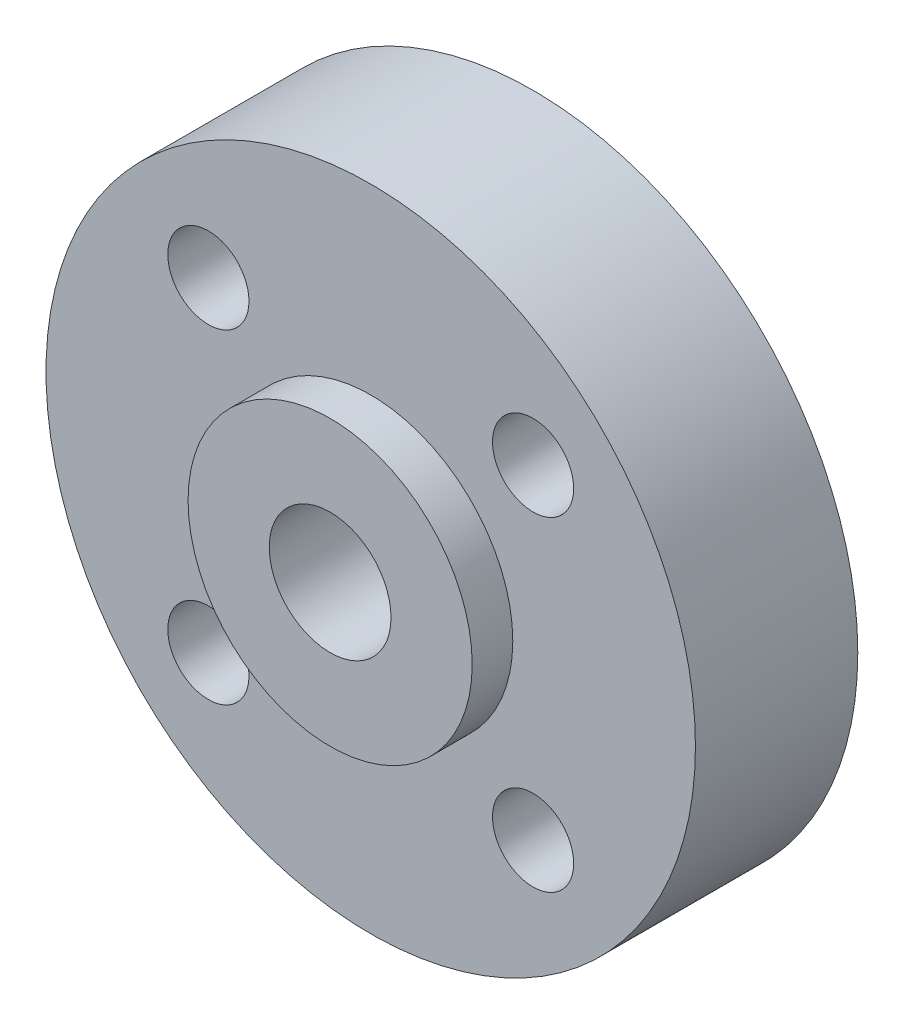
ISO-10303-21;
HEADER;
FILE_DESCRIPTION(('STEP AP214'),'2;1');
FILE_NAME('part.step','',(''),(''),'','','');
FILE_SCHEMA(('AUTOMOTIVE_DESIGN { 1 0 10303 214 1 1 1 1 }'));
ENDSEC;
DATA;
#1=APPLICATION_CONTEXT('core data for automotive mechanical design processes');
#2=APPLICATION_PROTOCOL_DEFINITION('international standard','automotive_design',2000,#1);
#3=PRODUCT_CONTEXT('',#1,'mechanical');
#4=PRODUCT('Part','Part','',(#3));
#5=PRODUCT_RELATED_PRODUCT_CATEGORY('part','',(#4));
#6=PRODUCT_DEFINITION_FORMATION('','',#4);
#7=PRODUCT_DEFINITION_CONTEXT('part definition',#1,'design');
#8=PRODUCT_DEFINITION('design','',#6,#7);
#9=PRODUCT_DEFINITION_SHAPE('','',#8);
#10=(LENGTH_UNIT() NAMED_UNIT(*) SI_UNIT(.MILLI.,.METRE.));
#11=(NAMED_UNIT(*) PLANE_ANGLE_UNIT() SI_UNIT($,.RADIAN.));
#12=(NAMED_UNIT(*) SI_UNIT($,.STERADIAN.) SOLID_ANGLE_UNIT());
#13=UNCERTAINTY_MEASURE_WITH_UNIT(LENGTH_MEASURE(1.E-05),#10,'distance_accuracy_value','');
#14=(GEOMETRIC_REPRESENTATION_CONTEXT(3) GLOBAL_UNCERTAINTY_ASSIGNED_CONTEXT((#13)) GLOBAL_UNIT_ASSIGNED_CONTEXT((#10,
#11,#12)) REPRESENTATION_CONTEXT('',''));
#15=CARTESIAN_POINT('',(0.,0.,0.));
#16=DIRECTION('',(0.,0.,1.));
#17=DIRECTION('',(1.,0.,0.));
#18=AXIS2_PLACEMENT_3D('',#15,#16,#17);
#19=CARTESIAN_POINT('',(0.,0.,8.));
#20=DIRECTION('',(0.,0.,-1.));
#21=DIRECTION('',(-1.,0.,0.));
#22=AXIS2_PLACEMENT_3D('',#19,#20,#21);
#23=CYLINDRICAL_SURFACE('',#22,16.);
#24=CARTESIAN_POINT('',(0.,0.,8.));
#25=DIRECTION('',(0.,0.,1.));
#26=DIRECTION('',(1.,0.,0.));
#27=AXIS2_PLACEMENT_3D('',#24,#25,#26);
#28=CIRCLE('',#27,16.);
#29=CARTESIAN_POINT('',(16.,0.,8.));
#30=VERTEX_POINT('',#29);
#31=EDGE_CURVE('E45',#30,#30,#28,.T.);
#32=ORIENTED_EDGE('',*,*,#31,.F.);
#33=EDGE_LOOP('',(#32));
#34=FACE_BOUND('',#33,.T.);
#35=CARTESIAN_POINT('',(0.,0.,0.));
#36=DIRECTION('',(0.,0.,1.));
#37=DIRECTION('',(1.,0.,0.));
#38=AXIS2_PLACEMENT_3D('',#35,#36,#37);
#39=CIRCLE('',#38,16.);
#40=CARTESIAN_POINT('',(16.,0.,0.));
#41=VERTEX_POINT('',#40);
#42=EDGE_CURVE('E50',#41,#41,#39,.T.);
#43=ORIENTED_EDGE('',*,*,#42,.T.);
#44=EDGE_LOOP('',(#43));
#45=FACE_BOUND('',#44,.T.);
#46=ADVANCED_FACE('F38',(#34,#45),#23,.T.);
#47=CARTESIAN_POINT('',(0.,0.,8.));
#48=DIRECTION('',(0.,0.,1.));
#49=DIRECTION('',(1.,0.,0.));
#50=AXIS2_PLACEMENT_3D('',#47,#48,#49);
#51=PLANE('',#50);
#52=CARTESIAN_POINT('',(-8.,-8.,8.));
#53=DIRECTION('',(0.,0.,1.));
#54=DIRECTION('',(1.,0.,0.));
#55=AXIS2_PLACEMENT_3D('',#52,#53,#54);
#56=CIRCLE('',#55,2.);
#57=CARTESIAN_POINT('',(-6.,-8.,8.));
#58=VERTEX_POINT('',#57);
#59=EDGE_CURVE('E106',#58,#58,#56,.T.);
#60=ORIENTED_EDGE('',*,*,#59,.F.);
#61=EDGE_LOOP('',(#60));
#62=FACE_BOUND('',#61,.T.);
#63=CARTESIAN_POINT('',(8.,-8.,8.));
#64=DIRECTION('',(0.,0.,1.));
#65=DIRECTION('',(1.,0.,0.));
#66=AXIS2_PLACEMENT_3D('',#63,#64,#65);
#67=CIRCLE('',#66,2.);
#68=CARTESIAN_POINT('',(10.,-8.,8.));
#69=VERTEX_POINT('',#68);
#70=EDGE_CURVE('E110',#69,#69,#67,.T.);
#71=ORIENTED_EDGE('',*,*,#70,.F.);
#72=EDGE_LOOP('',(#71));
#73=FACE_BOUND('',#72,.T.);
#74=CARTESIAN_POINT('',(8.,8.,8.));
#75=DIRECTION('',(0.,0.,1.));
#76=DIRECTION('',(1.,0.,0.));
#77=AXIS2_PLACEMENT_3D('',#74,#75,#76);
#78=CIRCLE('',#77,2.);
#79=CARTESIAN_POINT('',(10.,8.,8.));
#80=VERTEX_POINT('',#79);
#81=EDGE_CURVE('E114',#80,#80,#78,.T.);
#82=ORIENTED_EDGE('',*,*,#81,.F.);
#83=EDGE_LOOP('',(#82));
#84=FACE_BOUND('',#83,.T.);
#85=CARTESIAN_POINT('',(-8.,8.,8.));
#86=DIRECTION('',(0.,0.,1.));
#87=DIRECTION('',(1.,0.,0.));
#88=AXIS2_PLACEMENT_3D('',#85,#86,#87);
#89=CIRCLE('',#88,2.);
#90=CARTESIAN_POINT('',(-6.,8.,8.));
#91=VERTEX_POINT('',#90);
#92=EDGE_CURVE('E62',#91,#91,#89,.T.);
#93=ORIENTED_EDGE('',*,*,#92,.F.);
#94=EDGE_LOOP('',(#93));
#95=FACE_BOUND('',#94,.T.);
#96=CARTESIAN_POINT('',(0.,0.,8.));
#97=DIRECTION('',(0.,0.,1.));
#98=DIRECTION('',(1.,0.,0.));
#99=AXIS2_PLACEMENT_3D('',#96,#97,#98);
#100=CIRCLE('',#99,7.);
#101=CARTESIAN_POINT('',(7.,0.,8.));
#102=VERTEX_POINT('',#101);
#103=EDGE_CURVE('E10',#102,#102,#100,.T.);
#104=ORIENTED_EDGE('',*,*,#103,.F.);
#105=EDGE_LOOP('',(#104));
#106=FACE_BOUND('',#105,.T.);
#107=ORIENTED_EDGE('',*,*,#31,.T.);
#108=EDGE_LOOP('',(#107));
#109=FACE_BOUND('',#108,.T.);
#110=ADVANCED_FACE('F87',(#62,#73,#84,#95,#106,#109),#51,.T.);
#111=CARTESIAN_POINT('',(0.,0.,0.));
#112=DIRECTION('',(0.,0.,1.));
#113=DIRECTION('',(1.,0.,0.));
#114=AXIS2_PLACEMENT_3D('',#111,#112,#113);
#115=PLANE('',#114);
#116=CARTESIAN_POINT('',(0.,0.,0.));
#117=DIRECTION('',(0.,0.,1.));
#118=DIRECTION('',(1.,0.,0.));
#119=AXIS2_PLACEMENT_3D('',#116,#117,#118);
#120=CIRCLE('',#119,3.);
#121=CARTESIAN_POINT('',(3.,0.,0.));
#122=VERTEX_POINT('',#121);
#123=EDGE_CURVE('E122',#122,#122,#120,.T.);
#124=ORIENTED_EDGE('',*,*,#123,.T.);
#125=EDGE_LOOP('',(#124));
#126=FACE_BOUND('',#125,.T.);
#127=CARTESIAN_POINT('',(-8.,-8.,0.));
#128=DIRECTION('',(0.,0.,1.));
#129=DIRECTION('',(1.,0.,0.));
#130=AXIS2_PLACEMENT_3D('',#127,#128,#129);
#131=CIRCLE('',#130,2.);
#132=CARTESIAN_POINT('',(-6.,-8.,0.));
#133=VERTEX_POINT('',#132);
#134=EDGE_CURVE('E41',#133,#133,#131,.T.);
#135=ORIENTED_EDGE('',*,*,#134,.T.);
#136=EDGE_LOOP('',(#135));
#137=FACE_BOUND('',#136,.T.);
#138=CARTESIAN_POINT('',(8.,-8.,0.));
#139=DIRECTION('',(0.,0.,1.));
#140=DIRECTION('',(1.,0.,0.));
#141=AXIS2_PLACEMENT_3D('',#138,#139,#140);
#142=CIRCLE('',#141,2.);
#143=CARTESIAN_POINT('',(10.,-8.,0.));
#144=VERTEX_POINT('',#143);
#145=EDGE_CURVE('E64',#144,#144,#142,.T.);
#146=ORIENTED_EDGE('',*,*,#145,.T.);
#147=EDGE_LOOP('',(#146));
#148=FACE_BOUND('',#147,.T.);
#149=CARTESIAN_POINT('',(8.,8.,0.));
#150=DIRECTION('',(0.,0.,1.));
#151=DIRECTION('',(1.,0.,0.));
#152=AXIS2_PLACEMENT_3D('',#149,#150,#151);
#153=CIRCLE('',#152,2.);
#154=CARTESIAN_POINT('',(10.,8.,0.));
#155=VERTEX_POINT('',#154);
#156=EDGE_CURVE('E61',#155,#155,#153,.T.);
#157=ORIENTED_EDGE('',*,*,#156,.T.);
#158=EDGE_LOOP('',(#157));
#159=FACE_BOUND('',#158,.T.);
#160=CARTESIAN_POINT('',(-8.,8.,0.));
#161=DIRECTION('',(0.,0.,1.));
#162=DIRECTION('',(1.,0.,0.));
#163=AXIS2_PLACEMENT_3D('',#160,#161,#162);
#164=CIRCLE('',#163,2.);
#165=CARTESIAN_POINT('',(-6.,8.,0.));
#166=VERTEX_POINT('',#165);
#167=EDGE_CURVE('E58',#166,#166,#164,.T.);
#168=ORIENTED_EDGE('',*,*,#167,.T.);
#169=EDGE_LOOP('',(#168));
#170=FACE_BOUND('',#169,.T.);
#171=ORIENTED_EDGE('',*,*,#42,.F.);
#172=EDGE_LOOP('',(#171));
#173=FACE_BOUND('',#172,.T.);
#174=ADVANCED_FACE('F78',(#126,#137,#148,#159,#170,#173),#115,.F.);
#175=CARTESIAN_POINT('',(0.,0.,10.));
#176=DIRECTION('',(0.,0.,-1.));
#177=DIRECTION('',(-1.,0.,0.));
#178=AXIS2_PLACEMENT_3D('',#175,#176,#177);
#179=CYLINDRICAL_SURFACE('',#178,7.);
#180=CARTESIAN_POINT('',(0.,0.,10.));
#181=DIRECTION('',(0.,0.,1.));
#182=DIRECTION('',(1.,0.,0.));
#183=AXIS2_PLACEMENT_3D('',#180,#181,#182);
#184=CIRCLE('',#183,7.);
#185=CARTESIAN_POINT('',(7.,0.,10.));
#186=VERTEX_POINT('',#185);
#187=EDGE_CURVE('E53',#186,#186,#184,.T.);
#188=ORIENTED_EDGE('',*,*,#187,.F.);
#189=EDGE_LOOP('',(#188));
#190=FACE_BOUND('',#189,.T.);
#191=ORIENTED_EDGE('',*,*,#103,.T.);
#192=EDGE_LOOP('',(#191));
#193=FACE_BOUND('',#192,.T.);
#194=ADVANCED_FACE('F76',(#190,#193),#179,.T.);
#195=CARTESIAN_POINT('',(0.,0.,10.));
#196=DIRECTION('',(0.,0.,1.));
#197=DIRECTION('',(1.,0.,0.));
#198=AXIS2_PLACEMENT_3D('',#195,#196,#197);
#199=PLANE('',#198);
#200=CARTESIAN_POINT('',(0.,0.,10.));
#201=DIRECTION('',(0.,0.,1.));
#202=DIRECTION('',(1.,0.,0.));
#203=AXIS2_PLACEMENT_3D('',#200,#201,#202);
#204=CIRCLE('',#203,3.);
#205=CARTESIAN_POINT('',(3.,0.,10.));
#206=VERTEX_POINT('',#205);
#207=EDGE_CURVE('E126',#206,#206,#204,.T.);
#208=ORIENTED_EDGE('',*,*,#207,.F.);
#209=EDGE_LOOP('',(#208));
#210=FACE_BOUND('',#209,.T.);
#211=ORIENTED_EDGE('',*,*,#187,.T.);
#212=EDGE_LOOP('',(#211));
#213=FACE_BOUND('',#212,.T.);
#214=ADVANCED_FACE('F74',(#210,#213),#199,.T.);
#215=CARTESIAN_POINT('',(-8.,8.,-12.));
#216=DIRECTION('',(0.,0.,1.));
#217=DIRECTION('',(1.,0.,0.));
#218=AXIS2_PLACEMENT_3D('',#215,#216,#217);
#219=CYLINDRICAL_SURFACE('',#218,2.);
#220=ORIENTED_EDGE('',*,*,#92,.T.);
#221=EDGE_LOOP('',(#220));
#222=FACE_BOUND('',#221,.T.);
#223=ORIENTED_EDGE('',*,*,#167,.F.);
#224=EDGE_LOOP('',(#223));
#225=FACE_BOUND('',#224,.T.);
#226=ADVANCED_FACE('F84',(#222,#225),#219,.F.);
#227=CARTESIAN_POINT('',(8.,8.,-12.));
#228=DIRECTION('',(0.,0.,1.));
#229=DIRECTION('',(1.,0.,0.));
#230=AXIS2_PLACEMENT_3D('',#227,#228,#229);
#231=CYLINDRICAL_SURFACE('',#230,2.);
#232=ORIENTED_EDGE('',*,*,#81,.T.);
#233=EDGE_LOOP('',(#232));
#234=FACE_BOUND('',#233,.T.);
#235=ORIENTED_EDGE('',*,*,#156,.F.);
#236=EDGE_LOOP('',(#235));
#237=FACE_BOUND('',#236,.T.);
#238=ADVANCED_FACE('F142',(#234,#237),#231,.F.);
#239=CARTESIAN_POINT('',(8.,-8.,-12.));
#240=DIRECTION('',(0.,0.,1.));
#241=DIRECTION('',(1.,0.,0.));
#242=AXIS2_PLACEMENT_3D('',#239,#240,#241);
#243=CYLINDRICAL_SURFACE('',#242,2.);
#244=ORIENTED_EDGE('',*,*,#70,.T.);
#245=EDGE_LOOP('',(#244));
#246=FACE_BOUND('',#245,.T.);
#247=ORIENTED_EDGE('',*,*,#145,.F.);
#248=EDGE_LOOP('',(#247));
#249=FACE_BOUND('',#248,.T.);
#250=ADVANCED_FACE('F147',(#246,#249),#243,.F.);
#251=CARTESIAN_POINT('',(-8.,-8.,-12.));
#252=DIRECTION('',(0.,0.,1.));
#253=DIRECTION('',(1.,0.,0.));
#254=AXIS2_PLACEMENT_3D('',#251,#252,#253);
#255=CYLINDRICAL_SURFACE('',#254,2.);
#256=ORIENTED_EDGE('',*,*,#59,.T.);
#257=EDGE_LOOP('',(#256));
#258=FACE_BOUND('',#257,.T.);
#259=ORIENTED_EDGE('',*,*,#134,.F.);
#260=EDGE_LOOP('',(#259));
#261=FACE_BOUND('',#260,.T.);
#262=ADVANCED_FACE('F133',(#258,#261),#255,.F.);
#263=CARTESIAN_POINT('',(0.,0.,-10.));
#264=DIRECTION('',(0.,0.,1.));
#265=DIRECTION('',(1.,0.,0.));
#266=AXIS2_PLACEMENT_3D('',#263,#264,#265);
#267=CYLINDRICAL_SURFACE('',#266,3.);
#268=ORIENTED_EDGE('',*,*,#207,.T.);
#269=EDGE_LOOP('',(#268));
#270=FACE_BOUND('',#269,.T.);
#271=ORIENTED_EDGE('',*,*,#123,.F.);
#272=EDGE_LOOP('',(#271));
#273=FACE_BOUND('',#272,.T.);
#274=ADVANCED_FACE('F130',(#270,#273),#267,.F.);
#275=CLOSED_SHELL('',(#46,#110,#174,#194,#214,#226,#238,#250,#262,#274));
#276=MANIFOLD_SOLID_BREP('B2',#275);
#277=ADVANCED_BREP_SHAPE_REPRESENTATION('',(#18,#276),#14);
#278=SHAPE_DEFINITION_REPRESENTATION(#9,#277);
ENDSEC;
END-ISO-10303-21;
